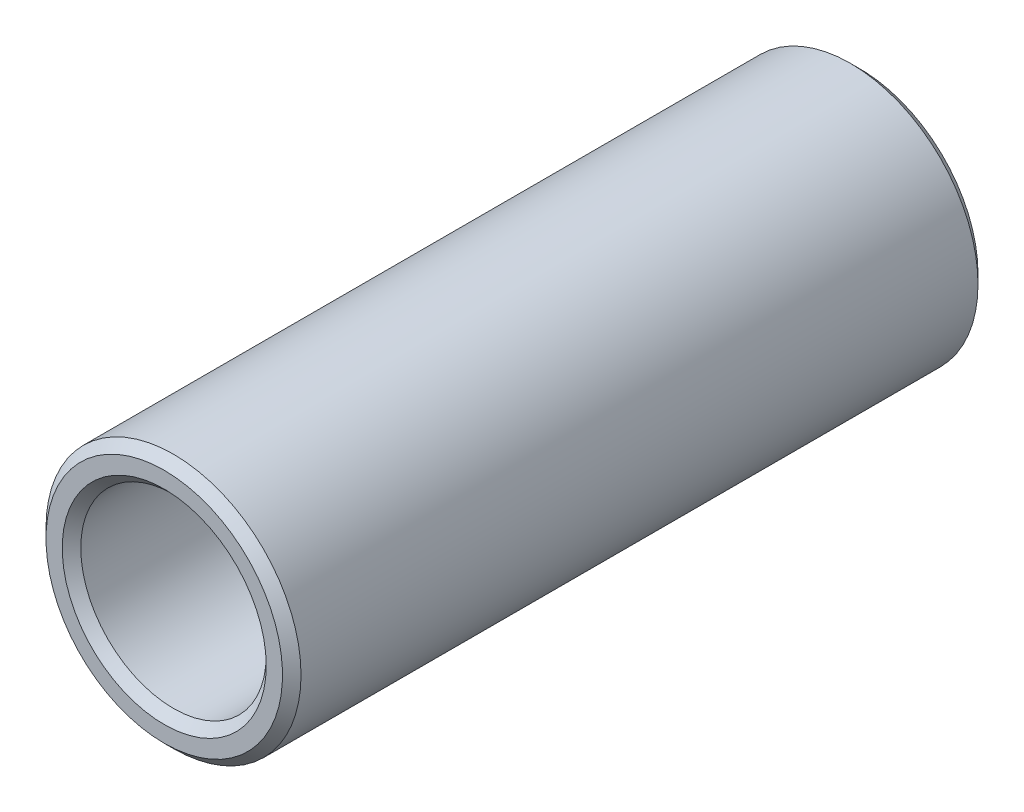
ISO-10303-21;
HEADER;
FILE_DESCRIPTION(('STEP AP214'),'2;1');
FILE_NAME('part.step','',(''),(''),'','','');
FILE_SCHEMA(('AUTOMOTIVE_DESIGN { 1 0 10303 214 1 1 1 1 }'));
ENDSEC;
DATA;
#1=APPLICATION_CONTEXT('core data for automotive mechanical design processes');
#2=APPLICATION_PROTOCOL_DEFINITION('international standard','automotive_design',2000,#1);
#3=PRODUCT_CONTEXT('',#1,'mechanical');
#4=PRODUCT('Part','Part','',(#3));
#5=PRODUCT_RELATED_PRODUCT_CATEGORY('part','',(#4));
#6=PRODUCT_DEFINITION_FORMATION('','',#4);
#7=PRODUCT_DEFINITION_CONTEXT('part definition',#1,'design');
#8=PRODUCT_DEFINITION('design','',#6,#7);
#9=PRODUCT_DEFINITION_SHAPE('','',#8);
#10=(LENGTH_UNIT() NAMED_UNIT(*) SI_UNIT(.MILLI.,.METRE.));
#11=(NAMED_UNIT(*) PLANE_ANGLE_UNIT() SI_UNIT($,.RADIAN.));
#12=(NAMED_UNIT(*) SI_UNIT($,.STERADIAN.) SOLID_ANGLE_UNIT());
#13=UNCERTAINTY_MEASURE_WITH_UNIT(LENGTH_MEASURE(1.E-05),#10,'distance_accuracy_value','');
#14=(GEOMETRIC_REPRESENTATION_CONTEXT(3) GLOBAL_UNCERTAINTY_ASSIGNED_CONTEXT((#13)) GLOBAL_UNIT_ASSIGNED_CONTEXT((#10,
#11,#12)) REPRESENTATION_CONTEXT('',''));
#15=CARTESIAN_POINT('',(0.,0.,0.));
#16=DIRECTION('',(0.,0.,1.));
#17=DIRECTION('',(1.,0.,0.));
#18=AXIS2_PLACEMENT_3D('',#15,#16,#17);
#19=CARTESIAN_POINT('',(0.,0.,15.));
#20=DIRECTION('',(0.,0.,-1.));
#21=DIRECTION('',(-1.,0.,0.));
#22=AXIS2_PLACEMENT_3D('',#19,#20,#21);
#23=CYLINDRICAL_SURFACE('',#22,4.);
#24=CARTESIAN_POINT('',(0.,0.,14.5999999999162));
#25=DIRECTION('',(0.,0.,1.));
#26=DIRECTION('',(1.,0.,0.));
#27=AXIS2_PLACEMENT_3D('',#24,#25,#26);
#28=CIRCLE('',#27,4.0000000000191);
#29=CARTESIAN_POINT('',(4.0000000000191,0.,14.5999999999162));
#30=VERTEX_POINT('',#29);
#31=EDGE_CURVE('E34',#30,#30,#28,.T.);
#32=ORIENTED_EDGE('',*,*,#31,.T.);
#33=EDGE_LOOP('',(#32));
#34=FACE_BOUND('',#33,.T.);
#35=CARTESIAN_POINT('',(0.,0.,-14.6000000000299));
#36=DIRECTION('',(0.,0.,-1.));
#37=DIRECTION('',(-1.,0.,0.));
#38=AXIS2_PLACEMENT_3D('',#35,#36,#37);
#39=CIRCLE('',#38,4.0000000000191);
#40=CARTESIAN_POINT('',(-4.0000000000191,0.,-14.6000000000299));
#41=VERTEX_POINT('',#40);
#42=EDGE_CURVE('E37',#41,#41,#39,.T.);
#43=ORIENTED_EDGE('',*,*,#42,.T.);
#44=EDGE_LOOP('',(#43));
#45=FACE_BOUND('',#44,.T.);
#46=ADVANCED_FACE('F15',(#34,#45),#23,.F.);
#47=CARTESIAN_POINT('',(0.,0.,-14.9999999999295));
#48=DIRECTION('',(0.,0.,-1.));
#49=DIRECTION('',(0.,1.,0.));
#50=AXIS2_PLACEMENT_3D('',#47,#48,#49);
#51=CONICAL_SURFACE('',#50,4.39999999991869,0.785398163397448);
#52=CARTESIAN_POINT('',(0.,0.,-14.9999999999864));
#53=DIRECTION('',(0.,0.,-1.));
#54=DIRECTION('',(0.,1.,0.));
#55=AXIS2_PLACEMENT_3D('',#52,#53,#54);
#56=CIRCLE('',#55,4.39999999997553);
#57=CARTESIAN_POINT('',(0.,4.39999999997553,-14.9999999999864));
#58=VERTEX_POINT('',#57);
#59=EDGE_CURVE('E18',#58,#58,#56,.T.);
#60=ORIENTED_EDGE('',*,*,#59,.T.);
#61=EDGE_LOOP('',(#60));
#62=FACE_BOUND('',#61,.T.);
#63=ORIENTED_EDGE('',*,*,#42,.F.);
#64=EDGE_LOOP('',(#63));
#65=FACE_BOUND('',#64,.T.);
#66=ADVANCED_FACE('F55',(#62,#65),#51,.F.);
#67=CARTESIAN_POINT('',(0.,0.,14.9999999999864));
#68=DIRECTION('',(0.,0.,1.));
#69=DIRECTION('',(1.,0.,0.));
#70=AXIS2_PLACEMENT_3D('',#67,#68,#69);
#71=CONICAL_SURFACE('',#70,4.40000000008922,0.785398163397448);
#72=ORIENTED_EDGE('',*,*,#31,.F.);
#73=EDGE_LOOP('',(#72));
#74=FACE_BOUND('',#73,.T.);
#75=CARTESIAN_POINT('',(0.,0.,14.9999999999864));
#76=DIRECTION('',(0.,0.,1.));
#77=DIRECTION('',(1.,0.,0.));
#78=AXIS2_PLACEMENT_3D('',#75,#76,#77);
#79=CIRCLE('',#78,4.40000000008922);
#80=CARTESIAN_POINT('',(4.40000000008922,0.,14.9999999999864));
#81=VERTEX_POINT('',#80);
#82=EDGE_CURVE('E48',#81,#81,#79,.F.);
#83=ORIENTED_EDGE('',*,*,#82,.F.);
#84=EDGE_LOOP('',(#83));
#85=FACE_BOUND('',#84,.T.);
#86=ADVANCED_FACE('F61',(#74,#85),#71,.F.);
#87=CARTESIAN_POINT('',(0.,0.,-15.));
#88=DIRECTION('',(0.,0.,1.));
#89=DIRECTION('',(1.,0.,0.));
#90=AXIS2_PLACEMENT_3D('',#87,#88,#89);
#91=PLANE('',#90);
#92=CARTESIAN_POINT('',(0.,0.,-14.9999999999295));
#93=DIRECTION('',(0.,0.,1.));
#94=DIRECTION('',(1.,0.,0.));
#95=AXIS2_PLACEMENT_3D('',#92,#93,#94);
#96=CIRCLE('',#95,5.10000000002719);
#97=CARTESIAN_POINT('',(5.10000000002719,0.,-14.9999999999295));
#98=VERTEX_POINT('',#97);
#99=EDGE_CURVE('E46',#98,#98,#96,.T.);
#100=ORIENTED_EDGE('',*,*,#99,.F.);
#101=EDGE_LOOP('',(#100));
#102=FACE_BOUND('',#101,.T.);
#103=ORIENTED_EDGE('',*,*,#59,.F.);
#104=EDGE_LOOP('',(#103));
#105=FACE_BOUND('',#104,.T.);
#106=ADVANCED_FACE('F58',(#102,#105),#91,.F.);
#107=CARTESIAN_POINT('',(0.,0.,15.));
#108=DIRECTION('',(0.,0.,1.));
#109=DIRECTION('',(1.,0.,0.));
#110=AXIS2_PLACEMENT_3D('',#107,#108,#109);
#111=PLANE('',#110);
#112=CARTESIAN_POINT('',(0.,0.,14.9999999999864));
#113=DIRECTION('',(0.,0.,-1.));
#114=DIRECTION('',(0.,1.,0.));
#115=AXIS2_PLACEMENT_3D('',#112,#113,#114);
#116=CIRCLE('',#115,5.10000000002719);
#117=CARTESIAN_POINT('',(0.,5.10000000002719,14.9999999999864));
#118=VERTEX_POINT('',#117);
#119=EDGE_CURVE('E27',#118,#118,#116,.T.);
#120=ORIENTED_EDGE('',*,*,#119,.F.);
#121=EDGE_LOOP('',(#120));
#122=FACE_BOUND('',#121,.T.);
#123=ORIENTED_EDGE('',*,*,#82,.T.);
#124=EDGE_LOOP('',(#123));
#125=FACE_BOUND('',#124,.T.);
#126=ADVANCED_FACE('F60',(#122,#125),#111,.T.);
#127=CARTESIAN_POINT('',(0.,0.,-14.6000000000299));
#128=DIRECTION('',(0.,0.,1.));
#129=DIRECTION('',(1.,0.,0.));
#130=AXIS2_PLACEMENT_3D('',#127,#128,#129);
#131=CONICAL_SURFACE('',#130,5.49999999992679,0.785398163397448);
#132=CARTESIAN_POINT('',(0.,0.,-14.6));
#133=DIRECTION('',(0.,0.,-1.));
#134=DIRECTION('',(-1.,0.,0.));
#135=AXIS2_PLACEMENT_3D('',#132,#133,#134);
#136=CIRCLE('',#135,5.5);
#137=CARTESIAN_POINT('',(-5.5,0.,-14.6));
#138=VERTEX_POINT('',#137);
#139=EDGE_CURVE('E22',#138,#138,#136,.F.);
#140=ORIENTED_EDGE('',*,*,#139,.F.);
#141=EDGE_LOOP('',(#140));
#142=FACE_BOUND('',#141,.T.);
#143=ORIENTED_EDGE('',*,*,#99,.T.);
#144=EDGE_LOOP('',(#143));
#145=FACE_BOUND('',#144,.T.);
#146=ADVANCED_FACE('F69',(#142,#145),#131,.T.);
#147=CARTESIAN_POINT('',(0.,0.,14.6000000000868));
#148=DIRECTION('',(0.,0.,-1.));
#149=DIRECTION('',(0.,1.,0.));
#150=AXIS2_PLACEMENT_3D('',#147,#148,#149);
#151=CONICAL_SURFACE('',#150,5.49999999992679,0.785398163397448);
#152=ORIENTED_EDGE('',*,*,#119,.T.);
#153=EDGE_LOOP('',(#152));
#154=FACE_BOUND('',#153,.T.);
#155=CARTESIAN_POINT('',(0.,0.,14.6));
#156=DIRECTION('',(0.,0.,-1.));
#157=DIRECTION('',(-1.,0.,0.));
#158=AXIS2_PLACEMENT_3D('',#155,#156,#157);
#159=CIRCLE('',#158,5.5);
#160=CARTESIAN_POINT('',(-5.5,0.,14.6));
#161=VERTEX_POINT('',#160);
#162=EDGE_CURVE('E9',#161,#161,#159,.T.);
#163=ORIENTED_EDGE('',*,*,#162,.F.);
#164=EDGE_LOOP('',(#163));
#165=FACE_BOUND('',#164,.T.);
#166=ADVANCED_FACE('F77',(#154,#165),#151,.T.);
#167=CARTESIAN_POINT('',(0.,0.,15.));
#168=DIRECTION('',(0.,0.,-1.));
#169=DIRECTION('',(-1.,0.,0.));
#170=AXIS2_PLACEMENT_3D('',#167,#168,#169);
#171=CYLINDRICAL_SURFACE('',#170,5.5);
#172=ORIENTED_EDGE('',*,*,#162,.T.);
#173=EDGE_LOOP('',(#172));
#174=FACE_BOUND('',#173,.T.);
#175=ORIENTED_EDGE('',*,*,#139,.T.);
#176=EDGE_LOOP('',(#175));
#177=FACE_BOUND('',#176,.T.);
#178=ADVANCED_FACE('F75',(#174,#177),#171,.T.);
#179=CLOSED_SHELL('',(#46,#66,#86,#106,#126,#146,#166,#178));
#180=MANIFOLD_SOLID_BREP('B1',#179);
#181=ADVANCED_BREP_SHAPE_REPRESENTATION('',(#18,#180),#14);
#182=SHAPE_DEFINITION_REPRESENTATION(#9,#181);
ENDSEC;
END-ISO-10303-21;
